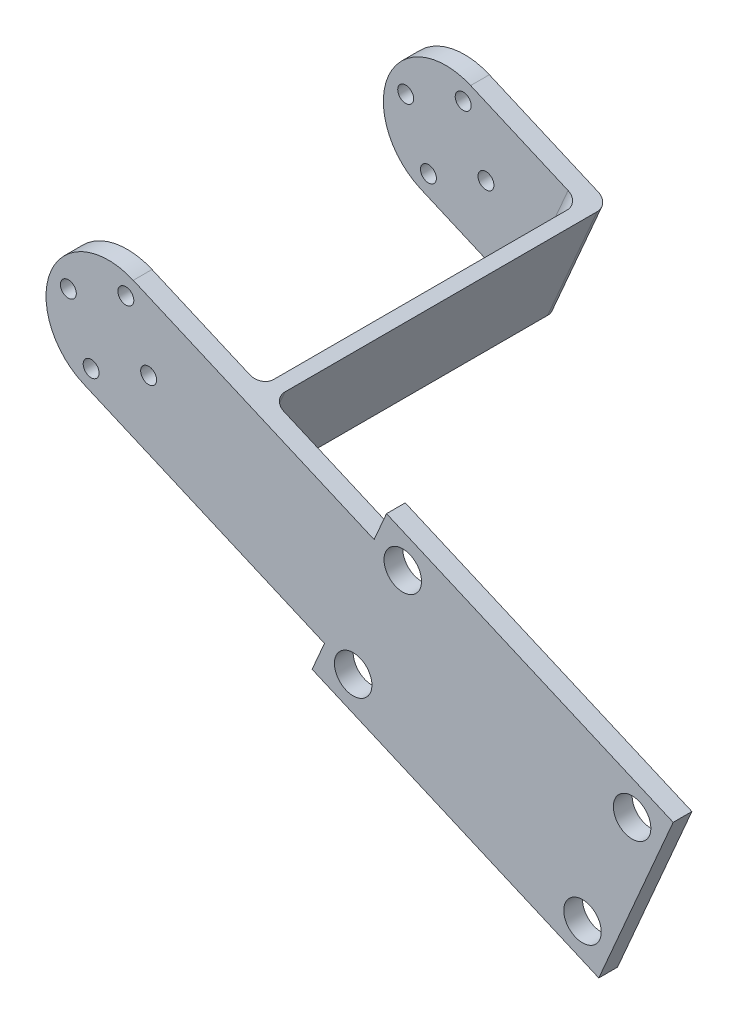
ISO-10303-21;
HEADER;
FILE_DESCRIPTION(('STEP AP214'),'2;1');
FILE_NAME('part.step','',(''),(''),'','','');
FILE_SCHEMA(('AUTOMOTIVE_DESIGN { 1 0 10303 214 1 1 1 1 }'));
ENDSEC;
DATA;
#1=APPLICATION_CONTEXT('core data for automotive mechanical design processes');
#2=APPLICATION_PROTOCOL_DEFINITION('international standard','automotive_design',2000,#1);
#3=PRODUCT_CONTEXT('',#1,'mechanical');
#4=PRODUCT('Part','Part','',(#3));
#5=PRODUCT_RELATED_PRODUCT_CATEGORY('part','',(#4));
#6=PRODUCT_DEFINITION_FORMATION('','',#4);
#7=PRODUCT_DEFINITION_CONTEXT('part definition',#1,'design');
#8=PRODUCT_DEFINITION('design','',#6,#7);
#9=PRODUCT_DEFINITION_SHAPE('','',#8);
#10=(LENGTH_UNIT() NAMED_UNIT(*) SI_UNIT(.MILLI.,.METRE.));
#11=(NAMED_UNIT(*) PLANE_ANGLE_UNIT() SI_UNIT($,.RADIAN.));
#12=(NAMED_UNIT(*) SI_UNIT($,.STERADIAN.) SOLID_ANGLE_UNIT());
#13=UNCERTAINTY_MEASURE_WITH_UNIT(LENGTH_MEASURE(1.E-05),#10,'distance_accuracy_value','');
#14=(GEOMETRIC_REPRESENTATION_CONTEXT(3) GLOBAL_UNCERTAINTY_ASSIGNED_CONTEXT((#13)) GLOBAL_UNIT_ASSIGNED_CONTEXT((#10,
#11,#12)) REPRESENTATION_CONTEXT('',''));
#15=CARTESIAN_POINT('',(0.,0.,0.));
#16=DIRECTION('',(0.,0.,1.));
#17=DIRECTION('',(1.,0.,0.));
#18=AXIS2_PLACEMENT_3D('',#15,#16,#17);
#19=CARTESIAN_POINT('',(0.,0.,-10.7555243648969));
#20=DIRECTION('',(0.,0.,1.));
#21=DIRECTION('',(1.,0.,0.));
#22=AXIS2_PLACEMENT_3D('',#19,#20,#21);
#23=PLANE('',#22);
#24=CARTESIAN_POINT('',(2.77872000126843,6.42485137217596,-10.7555243648969));
#25=DIRECTION('',(0.,0.,1.));
#26=DIRECTION('',(1.,0.,0.));
#27=AXIS2_PLACEMENT_3D('',#24,#25,#26);
#28=CIRCLE('',#27,1.275);
#29=CARTESIAN_POINT('',(4.05372000126843,6.42485137217596,-10.7555243648969));
#30=VERTEX_POINT('',#29);
#31=EDGE_CURVE('E246',#30,#30,#28,.T.);
#32=ORIENTED_EDGE('',*,*,#31,.T.);
#33=EDGE_LOOP('',(#32));
#34=FACE_BOUND('',#33,.T.);
#35=CARTESIAN_POINT('',(-6.424851372176,2.77872000126846,-10.7555243648969));
#36=DIRECTION('',(0.,0.,1.));
#37=DIRECTION('',(1.,0.,0.));
#38=AXIS2_PLACEMENT_3D('',#35,#36,#37);
#39=CIRCLE('',#38,1.275);
#40=CARTESIAN_POINT('',(-5.149851372176,2.77872000126846,-10.7555243648969));
#41=VERTEX_POINT('',#40);
#42=EDGE_CURVE('E254',#41,#41,#39,.T.);
#43=ORIENTED_EDGE('',*,*,#42,.T.);
#44=EDGE_LOOP('',(#43));
#45=FACE_BOUND('',#44,.T.);
#46=CARTESIAN_POINT('',(-2.77872000126847,-6.42485137217596,-10.7555243648969));
#47=DIRECTION('',(0.,0.,1.));
#48=DIRECTION('',(1.,0.,0.));
#49=AXIS2_PLACEMENT_3D('',#46,#47,#48);
#50=CIRCLE('',#49,1.275);
#51=CARTESIAN_POINT('',(-1.50372000126847,-6.42485137217596,-10.7555243648969));
#52=VERTEX_POINT('',#51);
#53=EDGE_CURVE('E262',#52,#52,#50,.T.);
#54=ORIENTED_EDGE('',*,*,#53,.T.);
#55=EDGE_LOOP('',(#54));
#56=FACE_BOUND('',#55,.T.);
#57=CARTESIAN_POINT('',(6.42485137217594,-2.77872000126839,-10.7555243648969));
#58=DIRECTION('',(0.,0.,1.));
#59=DIRECTION('',(1.,0.,0.));
#60=AXIS2_PLACEMENT_3D('',#57,#58,#59);
#61=CIRCLE('',#60,1.275);
#62=CARTESIAN_POINT('',(7.69985137217594,-2.77872000126839,-10.7555243648969));
#63=VERTEX_POINT('',#62);
#64=EDGE_CURVE('E270',#63,#63,#61,.T.);
#65=ORIENTED_EDGE('',*,*,#64,.T.);
#66=EDGE_LOOP('',(#65));
#67=FACE_BOUND('',#66,.T.);
#68=DIRECTION('',(-0.917835910310849,0.396960000181197,0.));
#69=VECTOR('',#68,1.);
#70=CARTESIAN_POINT('',(42.5187082348677,-7.49396090450156,-10.7555243648969));
#71=LINE('',#70,#69);
#72=CARTESIAN_POINT('',(19.5728104770965,2.43003910002833,-10.7555243648969));
#73=VERTEX_POINT('',#72);
#74=CARTESIAN_POINT('',(3.96960000181205,9.17835910310871,-10.7555243648969));
#75=VERTEX_POINT('',#74);
#76=EDGE_CURVE('E312',#73,#75,#71,.T.);
#77=ORIENTED_EDGE('',*,*,#76,.F.);
#78=DIRECTION('',(0.396960000181201,0.917835910310847,0.));
#79=VECTOR('',#78,1.);
#80=CARTESIAN_POINT('',(11.6336104734724,-15.926679106189,-10.7555243648969));
#81=LINE('',#80,#79);
#82=CARTESIAN_POINT('',(11.6336104734724,-15.926679106189,-10.7555243648969));
#83=VERTEX_POINT('',#82);
#84=EDGE_CURVE('E378',#73,#83,#81,.F.);
#85=ORIENTED_EDGE('',*,*,#84,.T.);
#86=DIRECTION('',(0.917835910310849,-0.396960000181196,0.));
#87=VECTOR('',#86,1.);
#88=CARTESIAN_POINT('',(34.5795082312436,-25.8506791107189,-10.7555243648969));
#89=LINE('',#88,#87);
#90=CARTESIAN_POINT('',(-3.96960000181205,-9.17835910310868,-10.7555243648969));
#91=VERTEX_POINT('',#90);
#92=EDGE_CURVE('E321',#91,#83,#89,.T.);
#93=ORIENTED_EDGE('',*,*,#92,.F.);
#94=CARTESIAN_POINT('',(0.,0.,-10.7555243648969));
#95=DIRECTION('',(0.,0.,1.));
#96=DIRECTION('',(1.,0.,0.));
#97=AXIS2_PLACEMENT_3D('',#94,#95,#96);
#98=CIRCLE('',#97,10.0000000000002);
#99=EDGE_CURVE('E317',#75,#91,#98,.T.);
#100=ORIENTED_EDGE('',*,*,#99,.F.);
#101=EDGE_LOOP('',(#77,#85,#93,#100));
#102=FACE_BOUND('',#101,.T.);
#103=ADVANCED_FACE('F39',(#34,#45,#56,#67,#102),#23,.F.);
#104=CARTESIAN_POINT('',(39.1686877827978,-27.8354791116249,-10.7555243648969));
#105=DIRECTION('',(0.,0.,1.));
#106=DIRECTION('',(1.,0.,0.));
#107=AXIS2_PLACEMENT_3D('',#104,#105,#106);
#108=CIRCLE('',#107,3.00000000000194);
#109=CARTESIAN_POINT('',(42.1686877827998,-27.8354791116249,-10.7555243648969));
#110=VERTEX_POINT('',#109);
#111=EDGE_CURVE('E217',#110,#110,#108,.T.);
#112=ORIENTED_EDGE('',*,*,#111,.T.);
#113=EDGE_LOOP('',(#112));
#114=FACE_BOUND('',#113,.T.);
#115=CARTESIAN_POINT('',(47.1078877864218,-9.47876090540748,-10.7555243648969));
#116=DIRECTION('',(0.,0.,1.));
#117=DIRECTION('',(1.,0.,0.));
#118=AXIS2_PLACEMENT_3D('',#115,#116,#117);
#119=CIRCLE('',#118,3.00000000000199);
#120=CARTESIAN_POINT('',(50.1078877864238,-9.47876090540748,-10.7555243648969));
#121=VERTEX_POINT('',#120);
#122=EDGE_CURVE('E222',#121,#121,#119,.T.);
#123=ORIENTED_EDGE('',*,*,#122,.T.);
#124=EDGE_LOOP('',(#123));
#125=FACE_BOUND('',#124,.T.);
#126=CARTESIAN_POINT('',(83.8213241988557,-25.3571609126553,-10.7555243648969));
#127=DIRECTION('',(0.,0.,1.));
#128=DIRECTION('',(1.,0.,0.));
#129=AXIS2_PLACEMENT_3D('',#126,#127,#128);
#130=CIRCLE('',#129,3.0000000000019);
#131=CARTESIAN_POINT('',(86.8213241988576,-25.3571609126553,-10.7555243648969));
#132=VERTEX_POINT('',#131);
#133=EDGE_CURVE('E230',#132,#132,#130,.T.);
#134=ORIENTED_EDGE('',*,*,#133,.T.);
#135=EDGE_LOOP('',(#134));
#136=FACE_BOUND('',#135,.T.);
#137=CARTESIAN_POINT('',(75.8821241952318,-43.7138791188728,-10.7555243648969));
#138=DIRECTION('',(0.,0.,1.));
#139=DIRECTION('',(1.,0.,0.));
#140=AXIS2_PLACEMENT_3D('',#137,#138,#139);
#141=CIRCLE('',#140,3.00000000000184);
#142=CARTESIAN_POINT('',(78.8821241952336,-43.7138791188728,-10.7555243648969));
#143=VERTEX_POINT('',#142);
#144=EDGE_CURVE('E238',#143,#143,#141,.T.);
#145=ORIENTED_EDGE('',*,*,#144,.T.);
#146=EDGE_LOOP('',(#145));
#147=FACE_BOUND('',#146,.T.);
#148=CARTESIAN_POINT('',(17.1406259353374,-18.3084391072762,-10.7555243648969));
#149=VERTEX_POINT('',#148);
#150=CARTESIAN_POINT('',(34.5795082312436,-25.8506791107189,-10.7555243648969));
#151=VERTEX_POINT('',#150);
#152=EDGE_CURVE('E320',#149,#151,#89,.T.);
#153=ORIENTED_EDGE('',*,*,#152,.F.);
#154=DIRECTION('',(-0.396960000181201,-0.917835910310847,0.));
#155=VECTOR('',#154,1.);
#156=CARTESIAN_POINT('',(25.0798259389616,0.0482790989411441,-10.7555243648969));
#157=LINE('',#156,#155);
#158=CARTESIAN_POINT('',(25.0798259389616,0.048279098941153,-10.7555243648969));
#159=VERTEX_POINT('',#158);
#160=EDGE_CURVE('E371',#149,#159,#157,.F.);
#161=ORIENTED_EDGE('',*,*,#160,.T.);
#162=CARTESIAN_POINT('',(42.5187082348677,-7.49396090450156,-10.7555243648969));
#163=VERTEX_POINT('',#162);
#164=EDGE_CURVE('E313',#163,#159,#71,.T.);
#165=ORIENTED_EDGE('',*,*,#164,.F.);
#166=DIRECTION('',(-0.396960000181196,-0.917835910310849,0.));
#167=VECTOR('',#166,1.);
#168=CARTESIAN_POINT('',(42.5187082348677,-7.49396090450156,-10.7555243648969));
#169=LINE('',#168,#167);
#170=CARTESIAN_POINT('',(44.5035082357732,-2.90478135294842,-10.7555243648969));
#171=VERTEX_POINT('',#170);
#172=EDGE_CURVE('E278',#171,#163,#169,.T.);
#173=ORIENTED_EDGE('',*,*,#172,.F.);
#174=DIRECTION('',(-0.917835910310849,0.396960000181196,0.));
#175=VECTOR('',#174,1.);
#176=CARTESIAN_POINT('',(44.5035082357732,-2.90478135294842,-10.7555243648969));
#177=LINE('',#176,#175);
#178=CARTESIAN_POINT('',(90.3953037513157,-22.7527813620082,-10.7555243648969));
#179=VERTEX_POINT('',#178);
#180=EDGE_CURVE('E287',#179,#171,#177,.T.);
#181=ORIENTED_EDGE('',*,*,#180,.F.);
#182=DIRECTION('',(0.396960000181196,0.917835910310849,0.));
#183=VECTOR('',#182,1.);
#184=CARTESIAN_POINT('',(78.4865037458805,-50.2878586713319,-10.7555243648969));
#185=LINE('',#184,#183);
#186=CARTESIAN_POINT('',(78.4865037458805,-50.2878586713319,-10.7555243648969));
#187=VERTEX_POINT('',#186);
#188=EDGE_CURVE('E331',#187,#179,#185,.T.);
#189=ORIENTED_EDGE('',*,*,#188,.F.);
#190=DIRECTION('',(0.917835910310849,-0.396960000181196,0.));
#191=VECTOR('',#190,1.);
#192=CARTESIAN_POINT('',(32.5947082303381,-30.4398586622721,-10.7555243648969));
#193=LINE('',#192,#191);
#194=CARTESIAN_POINT('',(32.5947082303381,-30.4398586622721,-10.7555243648969));
#195=VERTEX_POINT('',#194);
#196=EDGE_CURVE('E328',#195,#187,#193,.T.);
#197=ORIENTED_EDGE('',*,*,#196,.F.);
#198=DIRECTION('',(-0.396960000181195,-0.917835910310849,0.));
#199=VECTOR('',#198,1.);
#200=CARTESIAN_POINT('',(32.5947082303381,-30.4398586622721,-10.7555243648969));
#201=LINE('',#200,#199);
#202=EDGE_CURVE('E325',#151,#195,#201,.T.);
#203=ORIENTED_EDGE('',*,*,#202,.F.);
#204=EDGE_LOOP('',(#153,#161,#165,#173,#181,#189,#197,#203));
#205=FACE_BOUND('',#204,.T.);
#206=ADVANCED_FACE('F492',(#114,#125,#136,#147,#205),#23,.F.);
#207=CARTESIAN_POINT('',(0.,0.,-7.75552436489687));
#208=DIRECTION('',(0.,0.,1.));
#209=DIRECTION('',(1.,0.,0.));
#210=AXIS2_PLACEMENT_3D('',#207,#208,#209);
#211=PLANE('',#210);
#212=CARTESIAN_POINT('',(47.1078877864218,-9.47876090540748,-7.75552436489687));
#213=DIRECTION('',(0.,0.,1.));
#214=DIRECTION('',(1.,0.,0.));
#215=AXIS2_PLACEMENT_3D('',#212,#213,#214);
#216=CIRCLE('',#215,3.00000000000199);
#217=CARTESIAN_POINT('',(50.1078877864238,-9.47876090540748,-7.75552436489687));
#218=VERTEX_POINT('',#217);
#219=EDGE_CURVE('E226',#218,#218,#216,.T.);
#220=ORIENTED_EDGE('',*,*,#219,.F.);
#221=EDGE_LOOP('',(#220));
#222=FACE_BOUND('',#221,.T.);
#223=CARTESIAN_POINT('',(75.8821241952318,-43.7138791188728,-7.75552436489687));
#224=DIRECTION('',(0.,0.,1.));
#225=DIRECTION('',(1.,0.,0.));
#226=AXIS2_PLACEMENT_3D('',#223,#224,#225);
#227=CIRCLE('',#226,3.00000000000184);
#228=CARTESIAN_POINT('',(78.8821241952336,-43.7138791188728,-7.75552436489687));
#229=VERTEX_POINT('',#228);
#230=EDGE_CURVE('E242',#229,#229,#227,.T.);
#231=ORIENTED_EDGE('',*,*,#230,.F.);
#232=EDGE_LOOP('',(#231));
#233=FACE_BOUND('',#232,.T.);
#234=CARTESIAN_POINT('',(-6.424851372176,2.77872000126846,-7.75552436489687));
#235=DIRECTION('',(0.,0.,1.));
#236=DIRECTION('',(1.,0.,0.));
#237=AXIS2_PLACEMENT_3D('',#234,#235,#236);
#238=CIRCLE('',#237,1.275);
#239=CARTESIAN_POINT('',(-5.149851372176,2.77872000126846,-7.75552436489687));
#240=VERTEX_POINT('',#239);
#241=EDGE_CURVE('E258',#240,#240,#238,.T.);
#242=ORIENTED_EDGE('',*,*,#241,.F.);
#243=EDGE_LOOP('',(#242));
#244=FACE_BOUND('',#243,.T.);
#245=CARTESIAN_POINT('',(6.42485137217594,-2.77872000126839,-7.75552436489687));
#246=DIRECTION('',(0.,0.,1.));
#247=DIRECTION('',(1.,0.,0.));
#248=AXIS2_PLACEMENT_3D('',#245,#246,#247);
#249=CIRCLE('',#248,1.275);
#250=CARTESIAN_POINT('',(7.69985137217594,-2.77872000126839,-7.75552436489687));
#251=VERTEX_POINT('',#250);
#252=EDGE_CURVE('E274',#251,#251,#249,.T.);
#253=ORIENTED_EDGE('',*,*,#252,.F.);
#254=EDGE_LOOP('',(#253));
#255=FACE_BOUND('',#254,.T.);
#256=DIRECTION('',(-0.396960000181196,-0.917835910310849,0.));
#257=VECTOR('',#256,1.);
#258=CARTESIAN_POINT('',(42.5187082348677,-7.49396090450156,-7.75552436489687));
#259=LINE('',#258,#257);
#260=CARTESIAN_POINT('',(44.5035082357732,-2.90478135294842,-7.75552436489687));
#261=VERTEX_POINT('',#260);
#262=CARTESIAN_POINT('',(42.5187082348677,-7.49396090450156,-7.75552436489687));
#263=VERTEX_POINT('',#262);
#264=EDGE_CURVE('E282',#261,#263,#259,.T.);
#265=ORIENTED_EDGE('',*,*,#264,.T.);
#266=DIRECTION('',(-0.917835910310849,0.396960000181197,0.));
#267=VECTOR('',#266,1.);
#268=CARTESIAN_POINT('',(42.5187082348677,-7.49396090450156,-7.75552436489687));
#269=LINE('',#268,#267);
#270=CARTESIAN_POINT('',(3.96960000181205,9.17835910310871,-7.75552436489687));
#271=VERTEX_POINT('',#270);
#272=EDGE_CURVE('E286',#263,#271,#269,.T.);
#273=ORIENTED_EDGE('',*,*,#272,.T.);
#274=CARTESIAN_POINT('',(0.,0.,-7.75552436489687));
#275=DIRECTION('',(0.,0.,1.));
#276=DIRECTION('',(1.,0.,0.));
#277=AXIS2_PLACEMENT_3D('',#274,#275,#276);
#278=CIRCLE('',#277,10.0000000000002);
#279=CARTESIAN_POINT('',(-3.96960000181205,-9.17835910310868,-7.75552436489687));
#280=VERTEX_POINT('',#279);
#281=EDGE_CURVE('E290',#271,#280,#278,.T.);
#282=ORIENTED_EDGE('',*,*,#281,.T.);
#283=DIRECTION('',(0.917835910310849,-0.396960000181196,0.));
#284=VECTOR('',#283,1.);
#285=CARTESIAN_POINT('',(34.5795082312436,-25.8506791107189,-7.75552436489687));
#286=LINE('',#285,#284);
#287=CARTESIAN_POINT('',(34.5795082312436,-25.8506791107189,-7.75552436489687));
#288=VERTEX_POINT('',#287);
#289=EDGE_CURVE('E293',#280,#288,#286,.T.);
#290=ORIENTED_EDGE('',*,*,#289,.T.);
#291=DIRECTION('',(-0.396960000181195,-0.917835910310849,0.));
#292=VECTOR('',#291,1.);
#293=CARTESIAN_POINT('',(32.5947082303381,-30.4398586622721,-7.75552436489687));
#294=LINE('',#293,#292);
#295=CARTESIAN_POINT('',(32.5947082303381,-30.4398586622721,-7.75552436489687));
#296=VERTEX_POINT('',#295);
#297=EDGE_CURVE('E296',#288,#296,#294,.T.);
#298=ORIENTED_EDGE('',*,*,#297,.T.);
#299=DIRECTION('',(0.917835910310849,-0.396960000181196,0.));
#300=VECTOR('',#299,1.);
#301=CARTESIAN_POINT('',(32.5947082303381,-30.4398586622721,-7.75552436489687));
#302=LINE('',#301,#300);
#303=CARTESIAN_POINT('',(78.4865037458805,-50.2878586713319,-7.75552436489687));
#304=VERTEX_POINT('',#303);
#305=EDGE_CURVE('E299',#296,#304,#302,.T.);
#306=ORIENTED_EDGE('',*,*,#305,.T.);
#307=DIRECTION('',(0.396960000181196,0.917835910310849,0.));
#308=VECTOR('',#307,1.);
#309=CARTESIAN_POINT('',(78.4865037458805,-50.2878586713319,-7.75552436489687));
#310=LINE('',#309,#308);
#311=CARTESIAN_POINT('',(90.3953037513157,-22.7527813620082,-7.75552436489687));
#312=VERTEX_POINT('',#311);
#313=EDGE_CURVE('E302',#304,#312,#310,.T.);
#314=ORIENTED_EDGE('',*,*,#313,.T.);
#315=DIRECTION('',(-0.917835910310849,0.396960000181196,0.));
#316=VECTOR('',#315,1.);
#317=CARTESIAN_POINT('',(44.5035082357732,-2.90478135294842,-7.75552436489687));
#318=LINE('',#317,#316);
#319=EDGE_CURVE('E305',#312,#261,#318,.T.);
#320=ORIENTED_EDGE('',*,*,#319,.T.);
#321=EDGE_LOOP('',(#265,#273,#282,#290,#298,#306,#314,#320));
#322=FACE_BOUND('',#321,.T.);
#323=CARTESIAN_POINT('',(-2.77872000126847,-6.42485137217596,-7.75552436489687));
#324=DIRECTION('',(0.,0.,1.));
#325=DIRECTION('',(1.,0.,0.));
#326=AXIS2_PLACEMENT_3D('',#323,#324,#325);
#327=CIRCLE('',#326,1.275);
#328=CARTESIAN_POINT('',(-1.50372000126847,-6.42485137217596,-7.75552436489687));
#329=VERTEX_POINT('',#328);
#330=EDGE_CURVE('E266',#329,#329,#327,.T.);
#331=ORIENTED_EDGE('',*,*,#330,.F.);
#332=EDGE_LOOP('',(#331));
#333=FACE_BOUND('',#332,.T.);
#334=CARTESIAN_POINT('',(2.77872000126843,6.42485137217596,-7.75552436489687));
#335=DIRECTION('',(0.,0.,1.));
#336=DIRECTION('',(1.,0.,0.));
#337=AXIS2_PLACEMENT_3D('',#334,#335,#336);
#338=CIRCLE('',#337,1.275);
#339=CARTESIAN_POINT('',(4.05372000126843,6.42485137217596,-7.75552436489687));
#340=VERTEX_POINT('',#339);
#341=EDGE_CURVE('E250',#340,#340,#338,.T.);
#342=ORIENTED_EDGE('',*,*,#341,.F.);
#343=EDGE_LOOP('',(#342));
#344=FACE_BOUND('',#343,.T.);
#345=CARTESIAN_POINT('',(83.8213241988557,-25.3571609126553,-7.75552436489687));
#346=DIRECTION('',(0.,0.,1.));
#347=DIRECTION('',(1.,0.,0.));
#348=AXIS2_PLACEMENT_3D('',#345,#346,#347);
#349=CIRCLE('',#348,3.0000000000019);
#350=CARTESIAN_POINT('',(86.8213241988576,-25.3571609126553,-7.75552436489687));
#351=VERTEX_POINT('',#350);
#352=EDGE_CURVE('E234',#351,#351,#349,.T.);
#353=ORIENTED_EDGE('',*,*,#352,.F.);
#354=EDGE_LOOP('',(#353));
#355=FACE_BOUND('',#354,.T.);
#356=CARTESIAN_POINT('',(39.1686877827978,-27.8354791116249,-7.75552436489687));
#357=DIRECTION('',(0.,0.,1.));
#358=DIRECTION('',(1.,0.,0.));
#359=AXIS2_PLACEMENT_3D('',#356,#357,#358);
#360=CIRCLE('',#359,3.00000000000194);
#361=CARTESIAN_POINT('',(42.1686877827998,-27.8354791116249,-7.75552436489687));
#362=VERTEX_POINT('',#361);
#363=EDGE_CURVE('E218',#362,#362,#360,.T.);
#364=ORIENTED_EDGE('',*,*,#363,.F.);
#365=EDGE_LOOP('',(#364));
#366=FACE_BOUND('',#365,.T.);
#367=ADVANCED_FACE('F498',(#222,#233,#244,#255,#322,#333,#344,#355,#366),#211,.T.);
#368=CARTESIAN_POINT('',(42.5187082348677,-7.49396090450156,-7.75552436489687));
#369=DIRECTION('',(0.917835910310849,-0.396960000181196,0.));
#370=DIRECTION('',(0.396960000181197,0.917835910310849,0.));
#371=AXIS2_PLACEMENT_3D('',#368,#369,#370);
#372=PLANE('',#371);
#373=ORIENTED_EDGE('',*,*,#172,.T.);
#374=DIRECTION('',(0.,0.,-1.));
#375=VECTOR('',#374,1.);
#376=CARTESIAN_POINT('',(42.5187082348677,-7.49396090450156,-7.75552436489687));
#377=LINE('',#376,#375);
#378=EDGE_CURVE('E363',#263,#163,#377,.T.);
#379=ORIENTED_EDGE('',*,*,#378,.F.);
#380=ORIENTED_EDGE('',*,*,#264,.F.);
#381=DIRECTION('',(0.,0.,-1.));
#382=VECTOR('',#381,1.);
#383=CARTESIAN_POINT('',(44.5035082357732,-2.90478135294842,-7.75552436489687));
#384=LINE('',#383,#382);
#385=EDGE_CURVE('E308',#261,#171,#384,.T.);
#386=ORIENTED_EDGE('',*,*,#385,.T.);
#387=EDGE_LOOP('',(#373,#379,#380,#386));
#388=FACE_BOUND('',#387,.T.);
#389=ADVANCED_FACE('F527',(#388),#372,.F.);
#390=CARTESIAN_POINT('',(42.5187082348677,-7.49396090450156,-7.75552436489687));
#391=DIRECTION('',(-0.396960000181197,-0.917835910310849,0.));
#392=DIRECTION('',(0.917835910310849,-0.396960000181197,0.));
#393=AXIS2_PLACEMENT_3D('',#390,#391,#392);
#394=PLANE('',#393);
#395=DIRECTION('',(0.,0.,1.));
#396=VECTOR('',#395,1.);
#397=CARTESIAN_POINT('',(23.2441541183399,0.842199099303469,-61.7555243648969));
#398=LINE('',#397,#396);
#399=CARTESIAN_POINT('',(23.2441541183399,0.842199099303469,-62.7555243648969));
#400=VERTEX_POINT('',#399);
#401=CARTESIAN_POINT('',(23.2441541183399,0.842199099303469,-12.7555243648969));
#402=VERTEX_POINT('',#401);
#403=EDGE_CURVE('E214',#400,#402,#398,.T.);
#404=ORIENTED_EDGE('',*,*,#403,.F.);
#405=CARTESIAN_POINT('',(21.4084822977182,1.63611909966594,-62.7555243648969));
#406=DIRECTION('',(-0.396960000181197,-0.917835910310849,0.));
#407=DIRECTION('',(0.917835910310849,-0.396960000181197,0.));
#408=AXIS2_PLACEMENT_3D('',#405,#406,#407);
#409=CIRCLE('',#408,2.);
#410=CARTESIAN_POINT('',(21.4084822977182,1.6361190996659,-64.7555243648969));
#411=VERTEX_POINT('',#410);
#412=EDGE_CURVE('E403',#400,#411,#409,.F.);
#413=ORIENTED_EDGE('',*,*,#412,.T.);
#414=DIRECTION('',(0.91783591031084,-0.396960000181216,0.));
#415=VECTOR('',#414,1.);
#416=CARTESIAN_POINT('',(19.5728104770965,2.43003910002833,-64.7555243648969));
#417=LINE('',#416,#415);
#418=CARTESIAN_POINT('',(3.96960000181205,9.17835910310871,-64.7555243648969));
#419=VERTEX_POINT('',#418);
#420=EDGE_CURVE('E176',#419,#411,#417,.T.);
#421=ORIENTED_EDGE('',*,*,#420,.F.);
#422=DIRECTION('',(0.,0.,1.));
#423=VECTOR('',#422,1.);
#424=CARTESIAN_POINT('',(3.96960000181205,9.17835910310871,-64.7555243648969));
#425=LINE('',#424,#423);
#426=CARTESIAN_POINT('',(3.96960000181205,9.17835910310871,-61.7555243648969));
#427=VERTEX_POINT('',#426);
#428=EDGE_CURVE('E187',#419,#427,#425,.T.);
#429=ORIENTED_EDGE('',*,*,#428,.T.);
#430=DIRECTION('',(0.917835910310849,-0.396960000181197,0.));
#431=VECTOR('',#430,1.);
#432=CARTESIAN_POINT('',(19.5728104770965,2.43003910002833,-61.7555243648969));
#433=LINE('',#432,#431);
#434=CARTESIAN_POINT('',(19.5728104770965,2.43003910002833,-61.7555243648969));
#435=VERTEX_POINT('',#434);
#436=EDGE_CURVE('E203',#427,#435,#433,.T.);
#437=ORIENTED_EDGE('',*,*,#436,.T.);
#438=CARTESIAN_POINT('',(19.5728104770965,2.43003910002833,-59.7555243648969));
#439=DIRECTION('',(-0.396960000181197,-0.917835910310849,0.));
#440=DIRECTION('',(0.917835910310849,-0.396960000181197,0.));
#441=AXIS2_PLACEMENT_3D('',#438,#439,#440);
#442=CIRCLE('',#441,2.);
#443=CARTESIAN_POINT('',(21.4084822977182,1.63611909966587,-59.7555243648969));
#444=VERTEX_POINT('',#443);
#445=EDGE_CURVE('E48',#435,#444,#442,.T.);
#446=ORIENTED_EDGE('',*,*,#445,.T.);
#447=DIRECTION('',(0.,0.,1.));
#448=VECTOR('',#447,1.);
#449=CARTESIAN_POINT('',(21.4084822977182,1.63611909966587,-61.7555243648969));
#450=LINE('',#449,#448);
#451=CARTESIAN_POINT('',(21.4084822977182,1.63611909966587,-12.7555243648969));
#452=VERTEX_POINT('',#451);
#453=EDGE_CURVE('E186',#444,#452,#450,.T.);
#454=ORIENTED_EDGE('',*,*,#453,.T.);
#455=CARTESIAN_POINT('',(19.5728104770965,2.43003910002833,-12.7555243648969));
#456=DIRECTION('',(-0.396960000181197,-0.917835910310849,0.));
#457=DIRECTION('',(0.917835910310849,-0.396960000181197,0.));
#458=AXIS2_PLACEMENT_3D('',#455,#456,#457);
#459=CIRCLE('',#458,2.);
#460=EDGE_CURVE('E388',#452,#73,#459,.T.);
#461=ORIENTED_EDGE('',*,*,#460,.T.);
#462=ORIENTED_EDGE('',*,*,#76,.T.);
#463=DIRECTION('',(0.,0.,-1.));
#464=VECTOR('',#463,1.);
#465=CARTESIAN_POINT('',(3.96960000181205,9.17835910310871,-7.75552436489687));
#466=LINE('',#465,#464);
#467=EDGE_CURVE('E359',#271,#75,#466,.T.);
#468=ORIENTED_EDGE('',*,*,#467,.F.);
#469=ORIENTED_EDGE('',*,*,#272,.F.);
#470=ORIENTED_EDGE('',*,*,#378,.T.);
#471=ORIENTED_EDGE('',*,*,#164,.T.);
#472=CARTESIAN_POINT('',(25.0798259389616,0.0482790989411532,-12.7555243648969));
#473=DIRECTION('',(-0.396960000181197,-0.917835910310849,0.));
#474=DIRECTION('',(0.917835910310849,-0.396960000181197,0.));
#475=AXIS2_PLACEMENT_3D('',#472,#473,#474);
#476=CIRCLE('',#475,2.);
#477=EDGE_CURVE('E384',#159,#402,#476,.T.);
#478=ORIENTED_EDGE('',*,*,#477,.T.);
#479=EDGE_LOOP('',(#404,#413,#421,#429,#437,#446,#454,#461,#462,#468,#469,#470,#471,#478));
#480=FACE_BOUND('',#479,.T.);
#481=ADVANCED_FACE('F417',(#480),#394,.F.);
#482=CARTESIAN_POINT('',(0.,0.,-7.75552436489687));
#483=DIRECTION('',(0.,0.,-1.));
#484=DIRECTION('',(-1.,0.,0.));
#485=AXIS2_PLACEMENT_3D('',#482,#483,#484);
#486=CYLINDRICAL_SURFACE('',#485,10.0000000000002);
#487=ORIENTED_EDGE('',*,*,#99,.T.);
#488=DIRECTION('',(0.,0.,-1.));
#489=VECTOR('',#488,1.);
#490=CARTESIAN_POINT('',(-3.96960000181205,-9.17835910310868,-7.75552436489687));
#491=LINE('',#490,#489);
#492=EDGE_CURVE('E355',#280,#91,#491,.T.);
#493=ORIENTED_EDGE('',*,*,#492,.F.);
#494=ORIENTED_EDGE('',*,*,#281,.F.);
#495=ORIENTED_EDGE('',*,*,#467,.T.);
#496=EDGE_LOOP('',(#487,#493,#494,#495));
#497=FACE_BOUND('',#496,.T.);
#498=ADVANCED_FACE('F424',(#497),#486,.T.);
#499=CARTESIAN_POINT('',(34.5795082312436,-25.8506791107189,-7.75552436489687));
#500=DIRECTION('',(0.396960000181196,0.917835910310849,0.));
#501=DIRECTION('',(-0.917835910310849,0.396960000181196,0.));
#502=AXIS2_PLACEMENT_3D('',#499,#500,#501);
#503=PLANE('',#502);
#504=DIRECTION('',(-0.917835910310841,0.396960000181215,0.));
#505=VECTOR('',#504,1.);
#506=CARTESIAN_POINT('',(15.3049541147157,-17.5145191069139,-64.7555243648969));
#507=LINE('',#506,#505);
#508=CARTESIAN_POINT('',(13.469282294094,-16.7205991065514,-64.7555243648969));
#509=VERTEX_POINT('',#508);
#510=CARTESIAN_POINT('',(-3.96960000181205,-9.17835910310867,-64.7555243648969));
#511=VERTEX_POINT('',#510);
#512=EDGE_CURVE('E164',#509,#511,#507,.T.);
#513=ORIENTED_EDGE('',*,*,#512,.F.);
#514=CARTESIAN_POINT('',(13.469282294094,-16.7205991065514,-62.7555243648969));
#515=DIRECTION('',(0.396960000181196,0.917835910310849,0.));
#516=DIRECTION('',(-0.917835910310849,0.396960000181196,0.));
#517=AXIS2_PLACEMENT_3D('',#514,#515,#516);
#518=CIRCLE('',#517,2.);
#519=CARTESIAN_POINT('',(15.3049541147157,-17.5145191069139,-62.7555243648969));
#520=VERTEX_POINT('',#519);
#521=EDGE_CURVE('E397',#509,#520,#518,.F.);
#522=ORIENTED_EDGE('',*,*,#521,.T.);
#523=DIRECTION('',(0.,0.,1.));
#524=VECTOR('',#523,1.);
#525=CARTESIAN_POINT('',(15.3049541147157,-17.5145191069139,-61.7555243648969));
#526=LINE('',#525,#524);
#527=CARTESIAN_POINT('',(15.3049541147157,-17.5145191069139,-12.7555243648969));
#528=VERTEX_POINT('',#527);
#529=EDGE_CURVE('E211',#520,#528,#526,.T.);
#530=ORIENTED_EDGE('',*,*,#529,.T.);
#531=CARTESIAN_POINT('',(17.1406259353374,-18.3084391072762,-12.7555243648969));
#532=DIRECTION('',(0.396960000181196,0.917835910310849,0.));
#533=DIRECTION('',(-0.917835910310849,0.396960000181196,0.));
#534=AXIS2_PLACEMENT_3D('',#531,#532,#533);
#535=CIRCLE('',#534,2.);
#536=EDGE_CURVE('E381',#528,#149,#535,.T.);
#537=ORIENTED_EDGE('',*,*,#536,.T.);
#538=ORIENTED_EDGE('',*,*,#152,.T.);
#539=DIRECTION('',(0.,0.,-1.));
#540=VECTOR('',#539,1.);
#541=CARTESIAN_POINT('',(34.5795082312436,-25.8506791107189,-7.75552436489687));
#542=LINE('',#541,#540);
#543=EDGE_CURVE('E351',#288,#151,#542,.T.);
#544=ORIENTED_EDGE('',*,*,#543,.F.);
#545=ORIENTED_EDGE('',*,*,#289,.F.);
#546=ORIENTED_EDGE('',*,*,#492,.T.);
#547=ORIENTED_EDGE('',*,*,#92,.T.);
#548=CARTESIAN_POINT('',(11.6336104734723,-15.926679106189,-12.7555243648969));
#549=DIRECTION('',(0.396960000181196,0.917835910310849,0.));
#550=DIRECTION('',(-0.917835910310849,0.396960000181196,0.));
#551=AXIS2_PLACEMENT_3D('',#548,#549,#550);
#552=CIRCLE('',#551,2.);
#553=CARTESIAN_POINT('',(13.469282294094,-16.7205991065515,-12.7555243648969));
#554=VERTEX_POINT('',#553);
#555=EDGE_CURVE('E391',#83,#554,#552,.T.);
#556=ORIENTED_EDGE('',*,*,#555,.T.);
#557=DIRECTION('',(0.,0.,1.));
#558=VECTOR('',#557,1.);
#559=CARTESIAN_POINT('',(13.469282294094,-16.7205991065515,-61.7555243648969));
#560=LINE('',#559,#558);
#561=CARTESIAN_POINT('',(13.469282294094,-16.7205991065515,-59.7555243648969));
#562=VERTEX_POINT('',#561);
#563=EDGE_CURVE('E208',#562,#554,#560,.T.);
#564=ORIENTED_EDGE('',*,*,#563,.F.);
#565=CARTESIAN_POINT('',(11.6336104734723,-15.926679106189,-59.7555243648969));
#566=DIRECTION('',(0.396960000181196,0.917835910310849,0.));
#567=DIRECTION('',(-0.917835910310849,0.396960000181196,0.));
#568=AXIS2_PLACEMENT_3D('',#565,#566,#567);
#569=CIRCLE('',#568,2.);
#570=CARTESIAN_POINT('',(11.6336104734723,-15.926679106189,-61.7555243648969));
#571=VERTEX_POINT('',#570);
#572=EDGE_CURVE('E11',#562,#571,#569,.T.);
#573=ORIENTED_EDGE('',*,*,#572,.T.);
#574=DIRECTION('',(-0.917835910310849,0.396960000181197,0.));
#575=VECTOR('',#574,1.);
#576=CARTESIAN_POINT('',(-3.96960000181205,-9.17835910310868,-61.7555243648969));
#577=LINE('',#576,#575);
#578=CARTESIAN_POINT('',(-3.96960000181205,-9.17835910310867,-61.7555243648969));
#579=VERTEX_POINT('',#578);
#580=EDGE_CURVE('E182',#571,#579,#577,.T.);
#581=ORIENTED_EDGE('',*,*,#580,.T.);
#582=DIRECTION('',(0.,0.,1.));
#583=VECTOR('',#582,1.);
#584=CARTESIAN_POINT('',(-3.96960000181205,-9.17835910310867,-64.7555243648969));
#585=LINE('',#584,#583);
#586=EDGE_CURVE('E179',#511,#579,#585,.T.);
#587=ORIENTED_EDGE('',*,*,#586,.F.);
#588=EDGE_LOOP('',(#513,#522,#530,#537,#538,#544,#545,#546,#547,#556,#564,#573,#581,#587));
#589=FACE_BOUND('',#588,.T.);
#590=ADVANCED_FACE('F180',(#589),#503,.F.);
#591=CARTESIAN_POINT('',(32.5947082303381,-30.4398586622721,-7.75552436489687));
#592=DIRECTION('',(0.917835910310849,-0.396960000181195,0.));
#593=DIRECTION('',(0.396960000181195,0.917835910310849,0.));
#594=AXIS2_PLACEMENT_3D('',#591,#592,#593);
#595=PLANE('',#594);
#596=ORIENTED_EDGE('',*,*,#202,.T.);
#597=DIRECTION('',(0.,0.,-1.));
#598=VECTOR('',#597,1.);
#599=CARTESIAN_POINT('',(32.5947082303381,-30.4398586622721,-7.75552436489687));
#600=LINE('',#599,#598);
#601=EDGE_CURVE('E347',#296,#195,#600,.T.);
#602=ORIENTED_EDGE('',*,*,#601,.F.);
#603=ORIENTED_EDGE('',*,*,#297,.F.);
#604=ORIENTED_EDGE('',*,*,#543,.T.);
#605=EDGE_LOOP('',(#596,#602,#603,#604));
#606=FACE_BOUND('',#605,.T.);
#607=ADVANCED_FACE('F516',(#606),#595,.F.);
#608=CARTESIAN_POINT('',(32.5947082303381,-30.4398586622721,-7.75552436489687));
#609=DIRECTION('',(0.396960000181196,0.917835910310849,0.));
#610=DIRECTION('',(-0.917835910310849,0.396960000181196,0.));
#611=AXIS2_PLACEMENT_3D('',#608,#609,#610);
#612=PLANE('',#611);
#613=ORIENTED_EDGE('',*,*,#196,.T.);
#614=DIRECTION('',(0.,0.,-1.));
#615=VECTOR('',#614,1.);
#616=CARTESIAN_POINT('',(78.4865037458805,-50.2878586713319,-7.75552436489687));
#617=LINE('',#616,#615);
#618=EDGE_CURVE('E343',#304,#187,#617,.T.);
#619=ORIENTED_EDGE('',*,*,#618,.F.);
#620=ORIENTED_EDGE('',*,*,#305,.F.);
#621=ORIENTED_EDGE('',*,*,#601,.T.);
#622=EDGE_LOOP('',(#613,#619,#620,#621));
#623=FACE_BOUND('',#622,.T.);
#624=ADVANCED_FACE('F512',(#623),#612,.F.);
#625=CARTESIAN_POINT('',(78.4865037458805,-50.2878586713319,-7.75552436489687));
#626=DIRECTION('',(-0.917835910310849,0.396960000181196,0.));
#627=DIRECTION('',(-0.396960000181197,-0.917835910310849,0.));
#628=AXIS2_PLACEMENT_3D('',#625,#626,#627);
#629=PLANE('',#628);
#630=ORIENTED_EDGE('',*,*,#188,.T.);
#631=DIRECTION('',(0.,0.,-1.));
#632=VECTOR('',#631,1.);
#633=CARTESIAN_POINT('',(90.3953037513157,-22.7527813620082,-7.75552436489687));
#634=LINE('',#633,#632);
#635=EDGE_CURVE('E339',#312,#179,#634,.T.);
#636=ORIENTED_EDGE('',*,*,#635,.F.);
#637=ORIENTED_EDGE('',*,*,#313,.F.);
#638=ORIENTED_EDGE('',*,*,#618,.T.);
#639=EDGE_LOOP('',(#630,#636,#637,#638));
#640=FACE_BOUND('',#639,.T.);
#641=ADVANCED_FACE('F508',(#640),#629,.F.);
#642=CARTESIAN_POINT('',(44.5035082357732,-2.90478135294842,-7.75552436489687));
#643=DIRECTION('',(-0.396960000181196,-0.917835910310849,0.));
#644=DIRECTION('',(0.917835910310849,-0.396960000181196,0.));
#645=AXIS2_PLACEMENT_3D('',#642,#643,#644);
#646=PLANE('',#645);
#647=ORIENTED_EDGE('',*,*,#180,.T.);
#648=ORIENTED_EDGE('',*,*,#385,.F.);
#649=ORIENTED_EDGE('',*,*,#319,.F.);
#650=ORIENTED_EDGE('',*,*,#635,.T.);
#651=EDGE_LOOP('',(#647,#648,#649,#650));
#652=FACE_BOUND('',#651,.T.);
#653=ADVANCED_FACE('F504',(#652),#646,.F.);
#654=CARTESIAN_POINT('',(6.42485137217594,-2.77872000126839,-7.75552436489687));
#655=DIRECTION('',(0.,0.,-1.));
#656=DIRECTION('',(-1.,0.,0.));
#657=AXIS2_PLACEMENT_3D('',#654,#655,#656);
#658=CYLINDRICAL_SURFACE('',#657,1.275);
#659=ORIENTED_EDGE('',*,*,#252,.T.);
#660=EDGE_LOOP('',(#659));
#661=FACE_BOUND('',#660,.T.);
#662=ORIENTED_EDGE('',*,*,#64,.F.);
#663=EDGE_LOOP('',(#662));
#664=FACE_BOUND('',#663,.T.);
#665=ADVANCED_FACE('F507',(#661,#664),#658,.F.);
#666=CARTESIAN_POINT('',(-2.77872000126847,-6.42485137217596,-7.75552436489687));
#667=DIRECTION('',(0.,0.,-1.));
#668=DIRECTION('',(-1.,0.,0.));
#669=AXIS2_PLACEMENT_3D('',#666,#667,#668);
#670=CYLINDRICAL_SURFACE('',#669,1.275);
#671=ORIENTED_EDGE('',*,*,#330,.T.);
#672=EDGE_LOOP('',(#671));
#673=FACE_BOUND('',#672,.T.);
#674=ORIENTED_EDGE('',*,*,#53,.F.);
#675=EDGE_LOOP('',(#674));
#676=FACE_BOUND('',#675,.T.);
#677=ADVANCED_FACE('F615',(#673,#676),#670,.F.);
#678=CARTESIAN_POINT('',(-6.424851372176,2.77872000126846,-7.75552436489687));
#679=DIRECTION('',(0.,0.,-1.));
#680=DIRECTION('',(-1.,0.,0.));
#681=AXIS2_PLACEMENT_3D('',#678,#679,#680);
#682=CYLINDRICAL_SURFACE('',#681,1.275);
#683=ORIENTED_EDGE('',*,*,#241,.T.);
#684=EDGE_LOOP('',(#683));
#685=FACE_BOUND('',#684,.T.);
#686=ORIENTED_EDGE('',*,*,#42,.F.);
#687=EDGE_LOOP('',(#686));
#688=FACE_BOUND('',#687,.T.);
#689=ADVANCED_FACE('F608',(#685,#688),#682,.F.);
#690=CARTESIAN_POINT('',(2.77872000126843,6.42485137217596,-7.75552436489687));
#691=DIRECTION('',(0.,0.,-1.));
#692=DIRECTION('',(-1.,0.,0.));
#693=AXIS2_PLACEMENT_3D('',#690,#691,#692);
#694=CYLINDRICAL_SURFACE('',#693,1.275);
#695=ORIENTED_EDGE('',*,*,#341,.T.);
#696=EDGE_LOOP('',(#695));
#697=FACE_BOUND('',#696,.T.);
#698=ORIENTED_EDGE('',*,*,#31,.F.);
#699=EDGE_LOOP('',(#698));
#700=FACE_BOUND('',#699,.T.);
#701=ADVANCED_FACE('F599',(#697,#700),#694,.F.);
#702=CARTESIAN_POINT('',(75.8821241952318,-43.7138791188728,-7.75552436489687));
#703=DIRECTION('',(0.,0.,-1.));
#704=DIRECTION('',(-1.,0.,0.));
#705=AXIS2_PLACEMENT_3D('',#702,#703,#704);
#706=CYLINDRICAL_SURFACE('',#705,3.00000000000184);
#707=ORIENTED_EDGE('',*,*,#230,.T.);
#708=EDGE_LOOP('',(#707));
#709=FACE_BOUND('',#708,.T.);
#710=ORIENTED_EDGE('',*,*,#144,.F.);
#711=EDGE_LOOP('',(#710));
#712=FACE_BOUND('',#711,.T.);
#713=ADVANCED_FACE('F596',(#709,#712),#706,.F.);
#714=CARTESIAN_POINT('',(83.8213241988557,-25.3571609126553,-7.75552436489687));
#715=DIRECTION('',(0.,0.,-1.));
#716=DIRECTION('',(-1.,0.,0.));
#717=AXIS2_PLACEMENT_3D('',#714,#715,#716);
#718=CYLINDRICAL_SURFACE('',#717,3.0000000000019);
#719=ORIENTED_EDGE('',*,*,#352,.T.);
#720=EDGE_LOOP('',(#719));
#721=FACE_BOUND('',#720,.T.);
#722=ORIENTED_EDGE('',*,*,#133,.F.);
#723=EDGE_LOOP('',(#722));
#724=FACE_BOUND('',#723,.T.);
#725=ADVANCED_FACE('F598',(#721,#724),#718,.F.);
#726=CARTESIAN_POINT('',(47.1078877864218,-9.47876090540748,-7.75552436489687));
#727=DIRECTION('',(0.,0.,-1.));
#728=DIRECTION('',(-1.,0.,0.));
#729=AXIS2_PLACEMENT_3D('',#726,#727,#728);
#730=CYLINDRICAL_SURFACE('',#729,3.00000000000199);
#731=ORIENTED_EDGE('',*,*,#219,.T.);
#732=EDGE_LOOP('',(#731));
#733=FACE_BOUND('',#732,.T.);
#734=ORIENTED_EDGE('',*,*,#122,.F.);
#735=EDGE_LOOP('',(#734));
#736=FACE_BOUND('',#735,.T.);
#737=ADVANCED_FACE('F586',(#733,#736),#730,.F.);
#738=CARTESIAN_POINT('',(39.1686877827978,-27.8354791116249,-7.75552436489687));
#739=DIRECTION('',(0.,0.,-1.));
#740=DIRECTION('',(-1.,0.,0.));
#741=AXIS2_PLACEMENT_3D('',#738,#739,#740);
#742=CYLINDRICAL_SURFACE('',#741,3.00000000000194);
#743=ORIENTED_EDGE('',*,*,#363,.T.);
#744=EDGE_LOOP('',(#743));
#745=FACE_BOUND('',#744,.T.);
#746=ORIENTED_EDGE('',*,*,#111,.F.);
#747=EDGE_LOOP('',(#746));
#748=FACE_BOUND('',#747,.T.);
#749=ADVANCED_FACE('F583',(#745,#748),#742,.F.);
#750=CARTESIAN_POINT('',(23.2441541183399,0.842199099303469,-61.7555243648969));
#751=DIRECTION('',(-0.917835910310847,0.396960000181201,0.));
#752=DIRECTION('',(-0.396960000181201,-0.917835910310847,0.));
#753=AXIS2_PLACEMENT_3D('',#750,#751,#752);
#754=PLANE('',#753);
#755=ORIENTED_EDGE('',*,*,#529,.F.);
#756=DIRECTION('',(-0.396960000181201,-0.917835910310847,0.));
#757=VECTOR('',#756,1.);
#758=CARTESIAN_POINT('',(23.2441541183399,0.842199099303467,-62.7555243648969));
#759=LINE('',#758,#757);
#760=EDGE_CURVE('E400',#520,#400,#759,.F.);
#761=ORIENTED_EDGE('',*,*,#760,.T.);
#762=ORIENTED_EDGE('',*,*,#403,.T.);
#763=DIRECTION('',(-0.396960000181201,-0.917835910310847,0.));
#764=VECTOR('',#763,1.);
#765=CARTESIAN_POINT('',(15.3049541147157,-17.5145191069139,-12.7555243648969));
#766=LINE('',#765,#764);
#767=EDGE_CURVE('E367',#402,#528,#766,.T.);
#768=ORIENTED_EDGE('',*,*,#767,.T.);
#769=EDGE_LOOP('',(#755,#761,#762,#768));
#770=FACE_BOUND('',#769,.T.);
#771=ADVANCED_FACE('F549',(#770),#754,.F.);
#772=CARTESIAN_POINT('',(13.469282294094,-16.7205991065515,-61.7555243648969));
#773=DIRECTION('',(0.917835910310847,-0.396960000181201,0.));
#774=DIRECTION('',(0.396960000181201,0.917835910310847,0.));
#775=AXIS2_PLACEMENT_3D('',#772,#773,#774);
#776=PLANE('',#775);
#777=ORIENTED_EDGE('',*,*,#453,.F.);
#778=DIRECTION('',(0.396960000181201,0.917835910310847,0.));
#779=VECTOR('',#778,1.);
#780=CARTESIAN_POINT('',(13.469282294094,-16.7205991065515,-59.7555243648969));
#781=LINE('',#780,#779);
#782=EDGE_CURVE('E409',#444,#562,#781,.F.);
#783=ORIENTED_EDGE('',*,*,#782,.T.);
#784=ORIENTED_EDGE('',*,*,#563,.T.);
#785=DIRECTION('',(0.396960000181201,0.917835910310847,0.));
#786=VECTOR('',#785,1.);
#787=CARTESIAN_POINT('',(21.4084822977182,1.63611909966594,-12.7555243648969));
#788=LINE('',#787,#786);
#789=EDGE_CURVE('E374',#554,#452,#788,.T.);
#790=ORIENTED_EDGE('',*,*,#789,.T.);
#791=EDGE_LOOP('',(#777,#783,#784,#790));
#792=FACE_BOUND('',#791,.T.);
#793=ADVANCED_FACE('F434',(#792),#776,.F.);
#794=CARTESIAN_POINT('',(25.0798259389616,0.0482790989410672,-12.7555243648969));
#795=DIRECTION('',(0.396960000181201,0.917835910310847,0.));
#796=DIRECTION('',(-0.917835910310847,0.396960000181201,0.));
#797=AXIS2_PLACEMENT_3D('',#794,#795,#796);
#798=CYLINDRICAL_SURFACE('',#797,2.);
#799=ORIENTED_EDGE('',*,*,#477,.F.);
#800=ORIENTED_EDGE('',*,*,#160,.F.);
#801=ORIENTED_EDGE('',*,*,#536,.F.);
#802=ORIENTED_EDGE('',*,*,#767,.F.);
#803=EDGE_LOOP('',(#799,#800,#801,#802));
#804=FACE_BOUND('',#803,.T.);
#805=ADVANCED_FACE('F531',(#804),#798,.F.);
#806=CARTESIAN_POINT('',(11.6336104734723,-15.9266791061891,-12.7555243648969));
#807=DIRECTION('',(-0.396960000181201,-0.917835910310847,0.));
#808=DIRECTION('',(0.917835910310847,-0.396960000181201,0.));
#809=AXIS2_PLACEMENT_3D('',#806,#807,#808);
#810=CYLINDRICAL_SURFACE('',#809,2.);
#811=ORIENTED_EDGE('',*,*,#555,.F.);
#812=ORIENTED_EDGE('',*,*,#84,.F.);
#813=ORIENTED_EDGE('',*,*,#460,.F.);
#814=ORIENTED_EDGE('',*,*,#789,.F.);
#815=EDGE_LOOP('',(#811,#812,#813,#814));
#816=FACE_BOUND('',#815,.T.);
#817=ADVANCED_FACE('F432',(#816),#810,.F.);
#818=CARTESIAN_POINT('',(0.,0.,-61.7555243648969));
#819=DIRECTION('',(0.,0.,-1.));
#820=DIRECTION('',(-1.,0.,0.));
#821=AXIS2_PLACEMENT_3D('',#818,#819,#820);
#822=PLANE('',#821);
#823=CARTESIAN_POINT('',(-6.424851372176,2.77872000126846,-61.7555243648969));
#824=DIRECTION('',(0.,0.,-1.));
#825=DIRECTION('',(-1.,0.,0.));
#826=AXIS2_PLACEMENT_3D('',#823,#824,#825);
#827=CIRCLE('',#826,1.27499999999996);
#828=CARTESIAN_POINT('',(-7.69985137217596,2.77872000126846,-61.7555243648969));
#829=VERTEX_POINT('',#828);
#830=EDGE_CURVE('E442',#829,#829,#827,.T.);
#831=ORIENTED_EDGE('',*,*,#830,.T.);
#832=EDGE_LOOP('',(#831));
#833=FACE_BOUND('',#832,.T.);
#834=CARTESIAN_POINT('',(2.77872000126843,6.42485137217596,-61.7555243648969));
#835=DIRECTION('',(0.,0.,-1.));
#836=DIRECTION('',(-1.,0.,0.));
#837=AXIS2_PLACEMENT_3D('',#834,#835,#836);
#838=CIRCLE('',#837,1.27499999999996);
#839=CARTESIAN_POINT('',(1.50372000126847,6.42485137217596,-61.7555243648969));
#840=VERTEX_POINT('',#839);
#841=EDGE_CURVE('E450',#840,#840,#838,.T.);
#842=ORIENTED_EDGE('',*,*,#841,.T.);
#843=EDGE_LOOP('',(#842));
#844=FACE_BOUND('',#843,.T.);
#845=CARTESIAN_POINT('',(6.42485137217594,-2.77872000126839,-61.7555243648969));
#846=DIRECTION('',(0.,0.,-1.));
#847=DIRECTION('',(-1.,0.,0.));
#848=AXIS2_PLACEMENT_3D('',#845,#846,#847);
#849=CIRCLE('',#848,1.27499999999996);
#850=CARTESIAN_POINT('',(5.14985137217598,-2.77872000126839,-61.7555243648969));
#851=VERTEX_POINT('',#850);
#852=EDGE_CURVE('E458',#851,#851,#849,.T.);
#853=ORIENTED_EDGE('',*,*,#852,.T.);
#854=EDGE_LOOP('',(#853));
#855=FACE_BOUND('',#854,.T.);
#856=CARTESIAN_POINT('',(-2.77872000126847,-6.42485137217596,-61.7555243648969));
#857=DIRECTION('',(0.,0.,-1.));
#858=DIRECTION('',(-1.,0.,0.));
#859=AXIS2_PLACEMENT_3D('',#856,#857,#858);
#860=CIRCLE('',#859,1.27499999999996);
#861=CARTESIAN_POINT('',(-4.05372000126843,-6.42485137217596,-61.7555243648969));
#862=VERTEX_POINT('',#861);
#863=EDGE_CURVE('E466',#862,#862,#860,.T.);
#864=ORIENTED_EDGE('',*,*,#863,.T.);
#865=EDGE_LOOP('',(#864));
#866=FACE_BOUND('',#865,.T.);
#867=ORIENTED_EDGE('',*,*,#580,.F.);
#868=DIRECTION('',(0.396960000181201,0.917835910310847,0.));
#869=VECTOR('',#868,1.);
#870=CARTESIAN_POINT('',(19.5728104770965,2.43003910002834,-61.7555243648969));
#871=LINE('',#870,#869);
#872=EDGE_CURVE('E406',#571,#435,#871,.T.);
#873=ORIENTED_EDGE('',*,*,#872,.T.);
#874=ORIENTED_EDGE('',*,*,#436,.F.);
#875=CARTESIAN_POINT('',(0.,0.,-61.7555243648969));
#876=DIRECTION('',(0.,0.,-1.));
#877=DIRECTION('',(-1.,0.,0.));
#878=AXIS2_PLACEMENT_3D('',#875,#876,#877);
#879=CIRCLE('',#878,10.0000000000002);
#880=EDGE_CURVE('E199',#579,#427,#879,.T.);
#881=ORIENTED_EDGE('',*,*,#880,.F.);
#882=EDGE_LOOP('',(#867,#873,#874,#881));
#883=FACE_BOUND('',#882,.T.);
#884=ADVANCED_FACE('F438',(#833,#844,#855,#866,#883),#822,.F.);
#885=CARTESIAN_POINT('',(0.,0.,-64.7555243648969));
#886=DIRECTION('',(0.,0.,-1.));
#887=DIRECTION('',(-1.,0.,0.));
#888=AXIS2_PLACEMENT_3D('',#885,#886,#887);
#889=PLANE('',#888);
#890=CARTESIAN_POINT('',(6.42485137217594,-2.77872000126839,-64.7555243648969));
#891=DIRECTION('',(0.,0.,-1.));
#892=DIRECTION('',(-1.,0.,0.));
#893=AXIS2_PLACEMENT_3D('',#890,#891,#892);
#894=CIRCLE('',#893,1.27499999999996);
#895=CARTESIAN_POINT('',(5.14985137217598,-2.77872000126839,-64.7555243648969));
#896=VERTEX_POINT('',#895);
#897=EDGE_CURVE('E454',#896,#896,#894,.T.);
#898=ORIENTED_EDGE('',*,*,#897,.F.);
#899=EDGE_LOOP('',(#898));
#900=FACE_BOUND('',#899,.T.);
#901=CARTESIAN_POINT('',(-6.424851372176,2.77872000126846,-64.7555243648969));
#902=DIRECTION('',(0.,0.,-1.));
#903=DIRECTION('',(-1.,0.,0.));
#904=AXIS2_PLACEMENT_3D('',#901,#902,#903);
#905=CIRCLE('',#904,1.27499999999996);
#906=CARTESIAN_POINT('',(-7.69985137217596,2.77872000126846,-64.7555243648969));
#907=VERTEX_POINT('',#906);
#908=EDGE_CURVE('E200',#907,#907,#905,.T.);
#909=ORIENTED_EDGE('',*,*,#908,.F.);
#910=EDGE_LOOP('',(#909));
#911=FACE_BOUND('',#910,.T.);
#912=ORIENTED_EDGE('',*,*,#420,.T.);
#913=DIRECTION('',(-0.396960000181201,-0.917835910310847,0.));
#914=VECTOR('',#913,1.);
#915=CARTESIAN_POINT('',(13.469282294094,-16.7205991065515,-64.7555243648969));
#916=LINE('',#915,#914);
#917=EDGE_CURVE('E173',#411,#509,#916,.T.);
#918=ORIENTED_EDGE('',*,*,#917,.T.);
#919=ORIENTED_EDGE('',*,*,#512,.T.);
#920=CARTESIAN_POINT('',(0.,0.,-64.7555243648969));
#921=DIRECTION('',(0.,0.,-1.));
#922=DIRECTION('',(-1.,0.,0.));
#923=AXIS2_PLACEMENT_3D('',#920,#921,#922);
#924=CIRCLE('',#923,10.0000000000002);
#925=EDGE_CURVE('E170',#511,#419,#924,.T.);
#926=ORIENTED_EDGE('',*,*,#925,.T.);
#927=EDGE_LOOP('',(#912,#918,#919,#926));
#928=FACE_BOUND('',#927,.T.);
#929=CARTESIAN_POINT('',(2.77872000126843,6.42485137217596,-64.7555243648969));
#930=DIRECTION('',(0.,0.,-1.));
#931=DIRECTION('',(-1.,0.,0.));
#932=AXIS2_PLACEMENT_3D('',#929,#930,#931);
#933=CIRCLE('',#932,1.27499999999996);
#934=CARTESIAN_POINT('',(1.50372000126847,6.42485137217596,-64.7555243648969));
#935=VERTEX_POINT('',#934);
#936=EDGE_CURVE('E446',#935,#935,#933,.T.);
#937=ORIENTED_EDGE('',*,*,#936,.F.);
#938=EDGE_LOOP('',(#937));
#939=FACE_BOUND('',#938,.T.);
#940=CARTESIAN_POINT('',(-2.77872000126847,-6.42485137217596,-64.7555243648969));
#941=DIRECTION('',(0.,0.,-1.));
#942=DIRECTION('',(-1.,0.,0.));
#943=AXIS2_PLACEMENT_3D('',#940,#941,#942);
#944=CIRCLE('',#943,1.27499999999996);
#945=CARTESIAN_POINT('',(-4.05372000126843,-6.42485137217596,-64.7555243648969));
#946=VERTEX_POINT('',#945);
#947=EDGE_CURVE('E462',#946,#946,#944,.T.);
#948=ORIENTED_EDGE('',*,*,#947,.F.);
#949=EDGE_LOOP('',(#948));
#950=FACE_BOUND('',#949,.T.);
#951=ADVANCED_FACE('F167',(#900,#911,#928,#939,#950),#889,.T.);
#952=CARTESIAN_POINT('',(0.,0.,-64.7555243648969));
#953=DIRECTION('',(0.,0.,1.));
#954=DIRECTION('',(1.,0.,0.));
#955=AXIS2_PLACEMENT_3D('',#952,#953,#954);
#956=CYLINDRICAL_SURFACE('',#955,10.0000000000002);
#957=ORIENTED_EDGE('',*,*,#880,.T.);
#958=ORIENTED_EDGE('',*,*,#428,.F.);
#959=ORIENTED_EDGE('',*,*,#925,.F.);
#960=ORIENTED_EDGE('',*,*,#586,.T.);
#961=EDGE_LOOP('',(#957,#958,#959,#960));
#962=FACE_BOUND('',#961,.T.);
#963=ADVANCED_FACE('F189',(#962),#956,.T.);
#964=CARTESIAN_POINT('',(-6.424851372176,2.77872000126846,-64.7555243648969));
#965=DIRECTION('',(0.,0.,1.));
#966=DIRECTION('',(1.,0.,0.));
#967=AXIS2_PLACEMENT_3D('',#964,#965,#966);
#968=CYLINDRICAL_SURFACE('',#967,1.27499999999996);
#969=ORIENTED_EDGE('',*,*,#908,.T.);
#970=EDGE_LOOP('',(#969));
#971=FACE_BOUND('',#970,.T.);
#972=ORIENTED_EDGE('',*,*,#830,.F.);
#973=EDGE_LOOP('',(#972));
#974=FACE_BOUND('',#973,.T.);
#975=ADVANCED_FACE('F484',(#971,#974),#968,.F.);
#976=CARTESIAN_POINT('',(2.77872000126843,6.42485137217596,-64.7555243648969));
#977=DIRECTION('',(0.,0.,1.));
#978=DIRECTION('',(1.,0.,0.));
#979=AXIS2_PLACEMENT_3D('',#976,#977,#978);
#980=CYLINDRICAL_SURFACE('',#979,1.27499999999996);
#981=ORIENTED_EDGE('',*,*,#936,.T.);
#982=EDGE_LOOP('',(#981));
#983=FACE_BOUND('',#982,.T.);
#984=ORIENTED_EDGE('',*,*,#841,.F.);
#985=EDGE_LOOP('',(#984));
#986=FACE_BOUND('',#985,.T.);
#987=ADVANCED_FACE('F709',(#983,#986),#980,.F.);
#988=CARTESIAN_POINT('',(6.42485137217594,-2.77872000126839,-64.7555243648969));
#989=DIRECTION('',(0.,0.,1.));
#990=DIRECTION('',(1.,0.,0.));
#991=AXIS2_PLACEMENT_3D('',#988,#989,#990);
#992=CYLINDRICAL_SURFACE('',#991,1.27499999999996);
#993=ORIENTED_EDGE('',*,*,#897,.T.);
#994=EDGE_LOOP('',(#993));
#995=FACE_BOUND('',#994,.T.);
#996=ORIENTED_EDGE('',*,*,#852,.F.);
#997=EDGE_LOOP('',(#996));
#998=FACE_BOUND('',#997,.T.);
#999=ADVANCED_FACE('F543',(#995,#998),#992,.F.);
#1000=CARTESIAN_POINT('',(-2.77872000126847,-6.42485137217596,-64.7555243648969));
#1001=DIRECTION('',(0.,0.,1.));
#1002=DIRECTION('',(1.,0.,0.));
#1003=AXIS2_PLACEMENT_3D('',#1000,#1001,#1002);
#1004=CYLINDRICAL_SURFACE('',#1003,1.27499999999996);
#1005=ORIENTED_EDGE('',*,*,#947,.T.);
#1006=EDGE_LOOP('',(#1005));
#1007=FACE_BOUND('',#1006,.T.);
#1008=ORIENTED_EDGE('',*,*,#863,.F.);
#1009=EDGE_LOOP('',(#1008));
#1010=FACE_BOUND('',#1009,.T.);
#1011=ADVANCED_FACE('F474',(#1007,#1010),#1004,.F.);
#1012=CARTESIAN_POINT('',(17.4388822959061,-7.5422400034428,-62.7555243648969));
#1013=DIRECTION('',(0.396960000181201,0.917835910310847,0.));
#1014=DIRECTION('',(-0.917835910310847,0.396960000181201,0.));
#1015=AXIS2_PLACEMENT_3D('',#1012,#1013,#1014);
#1016=CYLINDRICAL_SURFACE('',#1015,2.);
#1017=ORIENTED_EDGE('',*,*,#412,.F.);
#1018=ORIENTED_EDGE('',*,*,#760,.F.);
#1019=ORIENTED_EDGE('',*,*,#521,.F.);
#1020=ORIENTED_EDGE('',*,*,#917,.F.);
#1021=EDGE_LOOP('',(#1017,#1018,#1019,#1020));
#1022=FACE_BOUND('',#1021,.T.);
#1023=ADVANCED_FACE('F536',(#1022),#1016,.T.);
#1024=CARTESIAN_POINT('',(15.6032104752844,-6.7483200030804,-59.7555243648969));
#1025=DIRECTION('',(-0.396960000181201,-0.917835910310847,0.));
#1026=DIRECTION('',(0.917835910310847,-0.396960000181201,0.));
#1027=AXIS2_PLACEMENT_3D('',#1024,#1025,#1026);
#1028=CYLINDRICAL_SURFACE('',#1027,2.);
#1029=ORIENTED_EDGE('',*,*,#572,.F.);
#1030=ORIENTED_EDGE('',*,*,#782,.F.);
#1031=ORIENTED_EDGE('',*,*,#445,.F.);
#1032=ORIENTED_EDGE('',*,*,#872,.F.);
#1033=EDGE_LOOP('',(#1029,#1030,#1031,#1032));
#1034=FACE_BOUND('',#1033,.T.);
#1035=ADVANCED_FACE('F41',(#1034),#1028,.F.);
#1036=CLOSED_SHELL('',(#103,#206,#367,#389,#481,#498,#590,#607,#624,#641,#653,#665,#677,#689,
#701,#713,#725,#737,#749,#771,#793,#805,#817,#884,#951,#963,#975,#987,#999,#1011,#1023,#1035));
#1037=MANIFOLD_SOLID_BREP('B2',#1036);
#1038=ADVANCED_BREP_SHAPE_REPRESENTATION('',(#18,#1037),#14);
#1039=SHAPE_DEFINITION_REPRESENTATION(#9,#1038);
ENDSEC;
END-ISO-10303-21;
